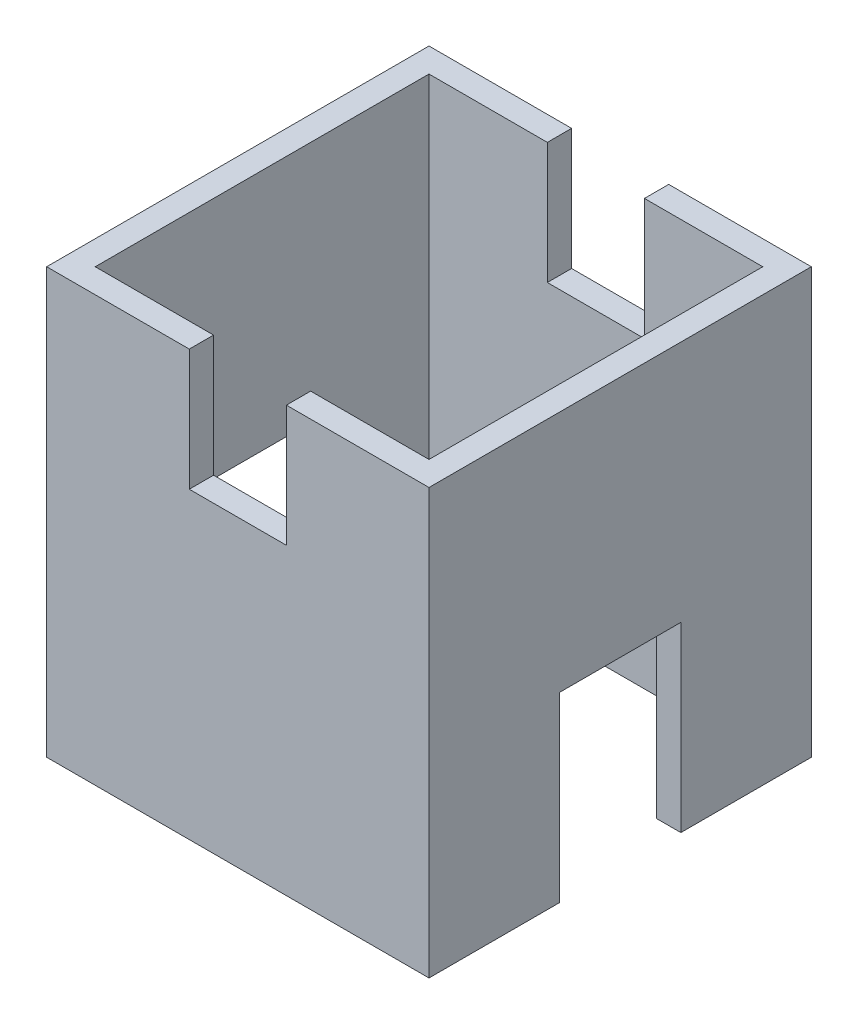
ISO-10303-21;
HEADER;
FILE_DESCRIPTION(('STEP AP214'),'2;1');
FILE_NAME('part.step','',(''),(''),'','','');
FILE_SCHEMA(('AUTOMOTIVE_DESIGN { 1 0 10303 214 1 1 1 1 }'));
ENDSEC;
DATA;
#1=APPLICATION_CONTEXT('core data for automotive mechanical design processes');
#2=APPLICATION_PROTOCOL_DEFINITION('international standard','automotive_design',2000,#1);
#3=PRODUCT_CONTEXT('',#1,'mechanical');
#4=PRODUCT('Part','Part','',(#3));
#5=PRODUCT_RELATED_PRODUCT_CATEGORY('part','',(#4));
#6=PRODUCT_DEFINITION_FORMATION('','',#4);
#7=PRODUCT_DEFINITION_CONTEXT('part definition',#1,'design');
#8=PRODUCT_DEFINITION('design','',#6,#7);
#9=PRODUCT_DEFINITION_SHAPE('','',#8);
#10=(LENGTH_UNIT() NAMED_UNIT(*) SI_UNIT(.MILLI.,.METRE.));
#11=(NAMED_UNIT(*) PLANE_ANGLE_UNIT() SI_UNIT($,.RADIAN.));
#12=(NAMED_UNIT(*) SI_UNIT($,.STERADIAN.) SOLID_ANGLE_UNIT());
#13=UNCERTAINTY_MEASURE_WITH_UNIT(LENGTH_MEASURE(1.E-05),#10,'distance_accuracy_value','');
#14=(GEOMETRIC_REPRESENTATION_CONTEXT(3) GLOBAL_UNCERTAINTY_ASSIGNED_CONTEXT((#13)) GLOBAL_UNIT_ASSIGNED_CONTEXT((#10,
#11,#12)) REPRESENTATION_CONTEXT('',''));
#15=CARTESIAN_POINT('',(0.,0.,0.));
#16=DIRECTION('',(0.,0.,1.));
#17=DIRECTION('',(1.,0.,0.));
#18=AXIS2_PLACEMENT_3D('',#15,#16,#17);
#19=CARTESIAN_POINT('',(0.,35.,0.));
#20=DIRECTION('',(0.,-1.,0.));
#21=DIRECTION('',(0.,0.,-1.));
#22=AXIS2_PLACEMENT_3D('',#19,#20,#21);
#23=PLANE('',#22);
#24=DIRECTION('',(-1.,0.,0.));
#25=VECTOR('',#24,1.);
#26=CARTESIAN_POINT('',(15.75,35.,-15.75));
#27=LINE('',#26,#25);
#28=CARTESIAN_POINT('',(15.75,35.,-15.75));
#29=VERTEX_POINT('',#28);
#30=CARTESIAN_POINT('',(4.,35.,-15.75));
#31=VERTEX_POINT('',#30);
#32=EDGE_CURVE('E319',#29,#31,#27,.T.);
#33=ORIENTED_EDGE('',*,*,#32,.T.);
#34=DIRECTION('',(0.,0.,-1.));
#35=VECTOR('',#34,1.);
#36=CARTESIAN_POINT('',(4.,35.,15.75));
#37=LINE('',#36,#35);
#38=CARTESIAN_POINT('',(4.,35.,-13.75));
#39=VERTEX_POINT('',#38);
#40=EDGE_CURVE('E226',#39,#31,#37,.T.);
#41=ORIENTED_EDGE('',*,*,#40,.F.);
#42=DIRECTION('',(-1.,0.,0.));
#43=VECTOR('',#42,1.);
#44=CARTESIAN_POINT('',(13.75,35.,-13.75));
#45=LINE('',#44,#43);
#46=CARTESIAN_POINT('',(13.75,35.,-13.75));
#47=VERTEX_POINT('',#46);
#48=EDGE_CURVE('E286',#47,#39,#45,.T.);
#49=ORIENTED_EDGE('',*,*,#48,.F.);
#50=DIRECTION('',(0.,0.,-1.));
#51=VECTOR('',#50,1.);
#52=CARTESIAN_POINT('',(13.75,35.,13.75));
#53=LINE('',#52,#51);
#54=CARTESIAN_POINT('',(13.75,35.,13.75));
#55=VERTEX_POINT('',#54);
#56=EDGE_CURVE('E282',#55,#47,#53,.T.);
#57=ORIENTED_EDGE('',*,*,#56,.F.);
#58=DIRECTION('',(1.,0.,0.));
#59=VECTOR('',#58,1.);
#60=CARTESIAN_POINT('',(13.75,35.,13.75));
#61=LINE('',#60,#59);
#62=CARTESIAN_POINT('',(4.,35.,13.75));
#63=VERTEX_POINT('',#62);
#64=EDGE_CURVE('E277',#63,#55,#61,.T.);
#65=ORIENTED_EDGE('',*,*,#64,.F.);
#66=CARTESIAN_POINT('',(4.,35.,15.75));
#67=VERTEX_POINT('',#66);
#68=EDGE_CURVE('E223',#67,#63,#37,.T.);
#69=ORIENTED_EDGE('',*,*,#68,.F.);
#70=DIRECTION('',(1.,0.,0.));
#71=VECTOR('',#70,1.);
#72=CARTESIAN_POINT('',(15.75,35.,15.75));
#73=LINE('',#72,#71);
#74=CARTESIAN_POINT('',(15.75,35.,15.75));
#75=VERTEX_POINT('',#74);
#76=EDGE_CURVE('E212',#67,#75,#73,.T.);
#77=ORIENTED_EDGE('',*,*,#76,.T.);
#78=DIRECTION('',(0.,0.,-1.));
#79=VECTOR('',#78,1.);
#80=CARTESIAN_POINT('',(15.75,35.,15.75));
#81=LINE('',#80,#79);
#82=EDGE_CURVE('E316',#75,#29,#81,.T.);
#83=ORIENTED_EDGE('',*,*,#82,.T.);
#84=EDGE_LOOP('',(#33,#41,#49,#57,#65,#69,#77,#83));
#85=FACE_BOUND('',#84,.T.);
#86=ADVANCED_FACE('F33',(#85),#23,.F.);
#87=CARTESIAN_POINT('',(0.,0.,0.));
#88=DIRECTION('',(0.,-1.,0.));
#89=DIRECTION('',(0.,0.,-1.));
#90=AXIS2_PLACEMENT_3D('',#87,#88,#89);
#91=PLANE('',#90);
#92=DIRECTION('',(1.,0.,0.));
#93=VECTOR('',#92,1.);
#94=CARTESIAN_POINT('',(-15.75,0.,5.));
#95=LINE('',#94,#93);
#96=CARTESIAN_POINT('',(13.75,0.,5.));
#97=VERTEX_POINT('',#96);
#98=CARTESIAN_POINT('',(15.75,0.,5.));
#99=VERTEX_POINT('',#98);
#100=EDGE_CURVE('E247',#97,#99,#95,.T.);
#101=ORIENTED_EDGE('',*,*,#100,.T.);
#102=DIRECTION('',(0.,0.,-1.));
#103=VECTOR('',#102,1.);
#104=CARTESIAN_POINT('',(15.75,0.,15.75));
#105=LINE('',#104,#103);
#106=CARTESIAN_POINT('',(15.75,0.,15.75));
#107=VERTEX_POINT('',#106);
#108=EDGE_CURVE('E328',#107,#99,#105,.T.);
#109=ORIENTED_EDGE('',*,*,#108,.F.);
#110=DIRECTION('',(1.,0.,0.));
#111=VECTOR('',#110,1.);
#112=CARTESIAN_POINT('',(15.75,0.,15.75));
#113=LINE('',#112,#111);
#114=CARTESIAN_POINT('',(-15.75,0.,15.75));
#115=VERTEX_POINT('',#114);
#116=EDGE_CURVE('E312',#115,#107,#113,.T.);
#117=ORIENTED_EDGE('',*,*,#116,.F.);
#118=DIRECTION('',(0.,0.,1.));
#119=VECTOR('',#118,1.);
#120=CARTESIAN_POINT('',(-15.75,0.,15.75));
#121=LINE('',#120,#119);
#122=CARTESIAN_POINT('',(-15.75,0.,5.));
#123=VERTEX_POINT('',#122);
#124=EDGE_CURVE('E333',#123,#115,#121,.T.);
#125=ORIENTED_EDGE('',*,*,#124,.F.);
#126=CARTESIAN_POINT('',(-13.75,0.,5.));
#127=VERTEX_POINT('',#126);
#128=EDGE_CURVE('E266',#123,#127,#95,.T.);
#129=ORIENTED_EDGE('',*,*,#128,.T.);
#130=DIRECTION('',(0.,0.,1.));
#131=VECTOR('',#130,1.);
#132=CARTESIAN_POINT('',(-13.75,0.,13.75));
#133=LINE('',#132,#131);
#134=CARTESIAN_POINT('',(-13.75,0.,13.75));
#135=VERTEX_POINT('',#134);
#136=EDGE_CURVE('E274',#127,#135,#133,.T.);
#137=ORIENTED_EDGE('',*,*,#136,.T.);
#138=DIRECTION('',(1.,0.,0.));
#139=VECTOR('',#138,1.);
#140=CARTESIAN_POINT('',(13.75,0.,13.75));
#141=LINE('',#140,#139);
#142=CARTESIAN_POINT('',(13.75,0.,13.75));
#143=VERTEX_POINT('',#142);
#144=EDGE_CURVE('E293',#135,#143,#141,.T.);
#145=ORIENTED_EDGE('',*,*,#144,.T.);
#146=DIRECTION('',(0.,0.,-1.));
#147=VECTOR('',#146,1.);
#148=CARTESIAN_POINT('',(13.75,0.,13.75));
#149=LINE('',#148,#147);
#150=EDGE_CURVE('E297',#143,#97,#149,.T.);
#151=ORIENTED_EDGE('',*,*,#150,.T.);
#152=EDGE_LOOP('',(#101,#109,#117,#125,#129,#137,#145,#151));
#153=FACE_BOUND('',#152,.T.);
#154=ADVANCED_FACE('F425',(#153),#91,.T.);
#155=CARTESIAN_POINT('',(-15.75,35.,15.75));
#156=VERTEX_POINT('',#155);
#157=CARTESIAN_POINT('',(-4.,35.,15.75));
#158=VERTEX_POINT('',#157);
#159=EDGE_CURVE('E313',#156,#158,#73,.T.);
#160=ORIENTED_EDGE('',*,*,#159,.T.);
#161=DIRECTION('',(0.,0.,-1.));
#162=VECTOR('',#161,1.);
#163=CARTESIAN_POINT('',(-4.,35.,15.75));
#164=LINE('',#163,#162);
#165=CARTESIAN_POINT('',(-4.,35.,13.75));
#166=VERTEX_POINT('',#165);
#167=EDGE_CURVE('E227',#158,#166,#164,.T.);
#168=ORIENTED_EDGE('',*,*,#167,.T.);
#169=CARTESIAN_POINT('',(-13.75,35.,13.75));
#170=VERTEX_POINT('',#169);
#171=EDGE_CURVE('E279',#170,#166,#61,.T.);
#172=ORIENTED_EDGE('',*,*,#171,.F.);
#173=DIRECTION('',(0.,0.,1.));
#174=VECTOR('',#173,1.);
#175=CARTESIAN_POINT('',(-13.75,35.,13.75));
#176=LINE('',#175,#174);
#177=CARTESIAN_POINT('',(-13.75,35.,-13.75));
#178=VERTEX_POINT('',#177);
#179=EDGE_CURVE('E275',#178,#170,#176,.T.);
#180=ORIENTED_EDGE('',*,*,#179,.F.);
#181=CARTESIAN_POINT('',(-4.,35.,-13.75));
#182=VERTEX_POINT('',#181);
#183=EDGE_CURVE('E285',#182,#178,#45,.T.);
#184=ORIENTED_EDGE('',*,*,#183,.F.);
#185=CARTESIAN_POINT('',(-4.,35.,-15.75));
#186=VERTEX_POINT('',#185);
#187=EDGE_CURVE('E230',#182,#186,#164,.T.);
#188=ORIENTED_EDGE('',*,*,#187,.T.);
#189=CARTESIAN_POINT('',(-15.75,35.,-15.75));
#190=VERTEX_POINT('',#189);
#191=EDGE_CURVE('E318',#186,#190,#27,.T.);
#192=ORIENTED_EDGE('',*,*,#191,.T.);
#193=DIRECTION('',(0.,0.,1.));
#194=VECTOR('',#193,1.);
#195=CARTESIAN_POINT('',(-15.75,35.,15.75));
#196=LINE('',#195,#194);
#197=EDGE_CURVE('E322',#190,#156,#196,.T.);
#198=ORIENTED_EDGE('',*,*,#197,.T.);
#199=EDGE_LOOP('',(#160,#168,#172,#180,#184,#188,#192,#198));
#200=FACE_BOUND('',#199,.T.);
#201=ADVANCED_FACE('F379',(#200),#23,.F.);
#202=DIRECTION('',(1.,0.,0.));
#203=VECTOR('',#202,1.);
#204=CARTESIAN_POINT('',(-15.75,0.,-5.00000000000001));
#205=LINE('',#204,#203);
#206=CARTESIAN_POINT('',(-15.75,0.,-5.00000000000001));
#207=VERTEX_POINT('',#206);
#208=CARTESIAN_POINT('',(-13.75,0.,-5.));
#209=VERTEX_POINT('',#208);
#210=EDGE_CURVE('E263',#207,#209,#205,.T.);
#211=ORIENTED_EDGE('',*,*,#210,.F.);
#212=CARTESIAN_POINT('',(-15.75,0.,-15.75));
#213=VERTEX_POINT('',#212);
#214=EDGE_CURVE('E334',#213,#207,#121,.T.);
#215=ORIENTED_EDGE('',*,*,#214,.F.);
#216=DIRECTION('',(-1.,0.,0.));
#217=VECTOR('',#216,1.);
#218=CARTESIAN_POINT('',(15.75,0.,-15.75));
#219=LINE('',#218,#217);
#220=CARTESIAN_POINT('',(15.75,0.,-15.75));
#221=VERTEX_POINT('',#220);
#222=EDGE_CURVE('E331',#221,#213,#219,.T.);
#223=ORIENTED_EDGE('',*,*,#222,.F.);
#224=CARTESIAN_POINT('',(15.75,0.,-5.00000000000001));
#225=VERTEX_POINT('',#224);
#226=EDGE_CURVE('E327',#225,#221,#105,.T.);
#227=ORIENTED_EDGE('',*,*,#226,.F.);
#228=CARTESIAN_POINT('',(13.75,0.,-5.00000000000001));
#229=VERTEX_POINT('',#228);
#230=EDGE_CURVE('E265',#229,#225,#205,.T.);
#231=ORIENTED_EDGE('',*,*,#230,.F.);
#232=CARTESIAN_POINT('',(13.75,0.,-13.75));
#233=VERTEX_POINT('',#232);
#234=EDGE_CURVE('E296',#229,#233,#149,.T.);
#235=ORIENTED_EDGE('',*,*,#234,.T.);
#236=DIRECTION('',(-1.,0.,0.));
#237=VECTOR('',#236,1.);
#238=CARTESIAN_POINT('',(13.75,0.,-13.75));
#239=LINE('',#238,#237);
#240=CARTESIAN_POINT('',(-13.75,0.,-13.75));
#241=VERTEX_POINT('',#240);
#242=EDGE_CURVE('E278',#233,#241,#239,.T.);
#243=ORIENTED_EDGE('',*,*,#242,.T.);
#244=EDGE_CURVE('E290',#241,#209,#133,.T.);
#245=ORIENTED_EDGE('',*,*,#244,.T.);
#246=EDGE_LOOP('',(#211,#215,#223,#227,#231,#235,#243,#245));
#247=FACE_BOUND('',#246,.T.);
#248=ADVANCED_FACE('F392',(#247),#91,.T.);
#249=CARTESIAN_POINT('',(15.75,35.,15.75));
#250=DIRECTION('',(0.,0.,-1.));
#251=DIRECTION('',(-1.,0.,0.));
#252=AXIS2_PLACEMENT_3D('',#249,#250,#251);
#253=PLANE('',#252);
#254=ORIENTED_EDGE('',*,*,#76,.F.);
#255=DIRECTION('',(0.,-1.,0.));
#256=VECTOR('',#255,1.);
#257=CARTESIAN_POINT('',(4.,25.,15.75));
#258=LINE('',#257,#256);
#259=CARTESIAN_POINT('',(4.,25.,15.75));
#260=VERTEX_POINT('',#259);
#261=EDGE_CURVE('E193',#67,#260,#258,.T.);
#262=ORIENTED_EDGE('',*,*,#261,.T.);
#263=DIRECTION('',(-1.,0.,0.));
#264=VECTOR('',#263,1.);
#265=CARTESIAN_POINT('',(-4.,25.,15.75));
#266=LINE('',#265,#264);
#267=CARTESIAN_POINT('',(-4.,25.,15.75));
#268=VERTEX_POINT('',#267);
#269=EDGE_CURVE('E201',#260,#268,#266,.T.);
#270=ORIENTED_EDGE('',*,*,#269,.T.);
#271=DIRECTION('',(0.,1.,0.));
#272=VECTOR('',#271,1.);
#273=CARTESIAN_POINT('',(-4.,25.,15.75));
#274=LINE('',#273,#272);
#275=EDGE_CURVE('E208',#268,#158,#274,.T.);
#276=ORIENTED_EDGE('',*,*,#275,.T.);
#277=ORIENTED_EDGE('',*,*,#159,.F.);
#278=DIRECTION('',(0.,-1.,0.));
#279=VECTOR('',#278,1.);
#280=CARTESIAN_POINT('',(-15.75,35.,15.75));
#281=LINE('',#280,#279);
#282=EDGE_CURVE('E324',#156,#115,#281,.T.);
#283=ORIENTED_EDGE('',*,*,#282,.T.);
#284=ORIENTED_EDGE('',*,*,#116,.T.);
#285=DIRECTION('',(0.,-1.,0.));
#286=VECTOR('',#285,1.);
#287=CARTESIAN_POINT('',(15.75,35.,15.75));
#288=LINE('',#287,#286);
#289=EDGE_CURVE('E345',#75,#107,#288,.T.);
#290=ORIENTED_EDGE('',*,*,#289,.F.);
#291=EDGE_LOOP('',(#254,#262,#270,#276,#277,#283,#284,#290));
#292=FACE_BOUND('',#291,.T.);
#293=ADVANCED_FACE('F35',(#292),#253,.F.);
#294=CARTESIAN_POINT('',(15.75,35.,15.75));
#295=DIRECTION('',(-1.,0.,0.));
#296=DIRECTION('',(0.,0.,1.));
#297=AXIS2_PLACEMENT_3D('',#294,#295,#296);
#298=PLANE('',#297);
#299=ORIENTED_EDGE('',*,*,#108,.T.);
#300=DIRECTION('',(0.,-1.,0.));
#301=VECTOR('',#300,1.);
#302=CARTESIAN_POINT('',(15.75,15.,5.));
#303=LINE('',#302,#301);
#304=CARTESIAN_POINT('',(15.75,15.,5.));
#305=VERTEX_POINT('',#304);
#306=EDGE_CURVE('E236',#305,#99,#303,.T.);
#307=ORIENTED_EDGE('',*,*,#306,.F.);
#308=DIRECTION('',(0.,0.,1.));
#309=VECTOR('',#308,1.);
#310=CARTESIAN_POINT('',(15.75,15.,-5.));
#311=LINE('',#310,#309);
#312=CARTESIAN_POINT('',(15.75,15.,-5.));
#313=VERTEX_POINT('',#312);
#314=EDGE_CURVE('E241',#313,#305,#311,.T.);
#315=ORIENTED_EDGE('',*,*,#314,.F.);
#316=DIRECTION('',(0.,1.,0.));
#317=VECTOR('',#316,1.);
#318=CARTESIAN_POINT('',(15.75,15.,-5.));
#319=LINE('',#318,#317);
#320=EDGE_CURVE('E249',#225,#313,#319,.T.);
#321=ORIENTED_EDGE('',*,*,#320,.F.);
#322=ORIENTED_EDGE('',*,*,#226,.T.);
#323=DIRECTION('',(0.,-1.,0.));
#324=VECTOR('',#323,1.);
#325=CARTESIAN_POINT('',(15.75,35.,-15.75));
#326=LINE('',#325,#324);
#327=EDGE_CURVE('E342',#29,#221,#326,.T.);
#328=ORIENTED_EDGE('',*,*,#327,.F.);
#329=ORIENTED_EDGE('',*,*,#82,.F.);
#330=ORIENTED_EDGE('',*,*,#289,.T.);
#331=EDGE_LOOP('',(#299,#307,#315,#321,#322,#328,#329,#330));
#332=FACE_BOUND('',#331,.T.);
#333=ADVANCED_FACE('F462',(#332),#298,.F.);
#334=CARTESIAN_POINT('',(15.75,35.,-15.75));
#335=DIRECTION('',(0.,0.,1.));
#336=DIRECTION('',(1.,0.,0.));
#337=AXIS2_PLACEMENT_3D('',#334,#335,#336);
#338=PLANE('',#337);
#339=DIRECTION('',(-1.,0.,0.));
#340=VECTOR('',#339,1.);
#341=CARTESIAN_POINT('',(-4.,25.,-15.75));
#342=LINE('',#341,#340);
#343=CARTESIAN_POINT('',(4.,25.,-15.75));
#344=VERTEX_POINT('',#343);
#345=CARTESIAN_POINT('',(-4.,25.,-15.75));
#346=VERTEX_POINT('',#345);
#347=EDGE_CURVE('E215',#344,#346,#342,.T.);
#348=ORIENTED_EDGE('',*,*,#347,.F.);
#349=DIRECTION('',(0.,-1.,0.));
#350=VECTOR('',#349,1.);
#351=CARTESIAN_POINT('',(4.,25.,-15.75));
#352=LINE('',#351,#350);
#353=EDGE_CURVE('E219',#31,#344,#352,.T.);
#354=ORIENTED_EDGE('',*,*,#353,.F.);
#355=ORIENTED_EDGE('',*,*,#32,.F.);
#356=ORIENTED_EDGE('',*,*,#327,.T.);
#357=ORIENTED_EDGE('',*,*,#222,.T.);
#358=DIRECTION('',(0.,-1.,0.));
#359=VECTOR('',#358,1.);
#360=CARTESIAN_POINT('',(-15.75,35.,-15.75));
#361=LINE('',#360,#359);
#362=EDGE_CURVE('E339',#190,#213,#361,.T.);
#363=ORIENTED_EDGE('',*,*,#362,.F.);
#364=ORIENTED_EDGE('',*,*,#191,.F.);
#365=DIRECTION('',(0.,1.,0.));
#366=VECTOR('',#365,1.);
#367=CARTESIAN_POINT('',(-4.,25.,-15.75));
#368=LINE('',#367,#366);
#369=EDGE_CURVE('E213',#346,#186,#368,.T.);
#370=ORIENTED_EDGE('',*,*,#369,.F.);
#371=EDGE_LOOP('',(#348,#354,#355,#356,#357,#363,#364,#370));
#372=FACE_BOUND('',#371,.T.);
#373=ADVANCED_FACE('F375',(#372),#338,.F.);
#374=CARTESIAN_POINT('',(-15.75,35.,15.75));
#375=DIRECTION('',(1.,0.,0.));
#376=DIRECTION('',(0.,0.,-1.));
#377=AXIS2_PLACEMENT_3D('',#374,#375,#376);
#378=PLANE('',#377);
#379=DIRECTION('',(0.,0.,1.));
#380=VECTOR('',#379,1.);
#381=CARTESIAN_POINT('',(-15.75,15.,-5.));
#382=LINE('',#381,#380);
#383=CARTESIAN_POINT('',(-15.75,15.,-5.));
#384=VERTEX_POINT('',#383);
#385=CARTESIAN_POINT('',(-15.75,15.,5.));
#386=VERTEX_POINT('',#385);
#387=EDGE_CURVE('E244',#384,#386,#382,.T.);
#388=ORIENTED_EDGE('',*,*,#387,.T.);
#389=DIRECTION('',(0.,-1.,0.));
#390=VECTOR('',#389,1.);
#391=CARTESIAN_POINT('',(-15.75,15.,5.));
#392=LINE('',#391,#390);
#393=EDGE_CURVE('E237',#386,#123,#392,.T.);
#394=ORIENTED_EDGE('',*,*,#393,.T.);
#395=ORIENTED_EDGE('',*,*,#124,.T.);
#396=ORIENTED_EDGE('',*,*,#282,.F.);
#397=ORIENTED_EDGE('',*,*,#197,.F.);
#398=ORIENTED_EDGE('',*,*,#362,.T.);
#399=ORIENTED_EDGE('',*,*,#214,.T.);
#400=DIRECTION('',(0.,1.,0.));
#401=VECTOR('',#400,1.);
#402=CARTESIAN_POINT('',(-15.75,15.,-5.));
#403=LINE('',#402,#401);
#404=EDGE_CURVE('E240',#207,#384,#403,.T.);
#405=ORIENTED_EDGE('',*,*,#404,.T.);
#406=EDGE_LOOP('',(#388,#394,#395,#396,#397,#398,#399,#405));
#407=FACE_BOUND('',#406,.T.);
#408=ADVANCED_FACE('F411',(#407),#378,.F.);
#409=CARTESIAN_POINT('',(-13.75,35.,13.75));
#410=DIRECTION('',(1.,0.,0.));
#411=DIRECTION('',(0.,0.,-1.));
#412=AXIS2_PLACEMENT_3D('',#409,#410,#411);
#413=PLANE('',#412);
#414=DIRECTION('',(0.,-1.,0.));
#415=VECTOR('',#414,1.);
#416=CARTESIAN_POINT('',(-13.75,35.,5.));
#417=LINE('',#416,#415);
#418=CARTESIAN_POINT('',(-13.75,15.,5.));
#419=VERTEX_POINT('',#418);
#420=EDGE_CURVE('E272',#419,#127,#417,.T.);
#421=ORIENTED_EDGE('',*,*,#420,.F.);
#422=DIRECTION('',(0.,0.,1.));
#423=VECTOR('',#422,1.);
#424=CARTESIAN_POINT('',(-13.75,15.,13.75));
#425=LINE('',#424,#423);
#426=CARTESIAN_POINT('',(-13.75,15.,-5.));
#427=VERTEX_POINT('',#426);
#428=EDGE_CURVE('E270',#427,#419,#425,.T.);
#429=ORIENTED_EDGE('',*,*,#428,.F.);
#430=DIRECTION('',(0.,1.,0.));
#431=VECTOR('',#430,1.);
#432=CARTESIAN_POINT('',(-13.75,35.,-4.99999999999999));
#433=LINE('',#432,#431);
#434=EDGE_CURVE('E257',#209,#427,#433,.T.);
#435=ORIENTED_EDGE('',*,*,#434,.F.);
#436=ORIENTED_EDGE('',*,*,#244,.F.);
#437=DIRECTION('',(0.,-1.,0.));
#438=VECTOR('',#437,1.);
#439=CARTESIAN_POINT('',(-13.75,35.,-13.75));
#440=LINE('',#439,#438);
#441=EDGE_CURVE('E289',#178,#241,#440,.T.);
#442=ORIENTED_EDGE('',*,*,#441,.F.);
#443=ORIENTED_EDGE('',*,*,#179,.T.);
#444=DIRECTION('',(0.,-1.,0.));
#445=VECTOR('',#444,1.);
#446=CARTESIAN_POINT('',(-13.75,35.,13.75));
#447=LINE('',#446,#445);
#448=EDGE_CURVE('E309',#170,#135,#447,.T.);
#449=ORIENTED_EDGE('',*,*,#448,.T.);
#450=ORIENTED_EDGE('',*,*,#136,.F.);
#451=EDGE_LOOP('',(#421,#429,#435,#436,#442,#443,#449,#450));
#452=FACE_BOUND('',#451,.T.);
#453=ADVANCED_FACE('F386',(#452),#413,.T.);
#454=CARTESIAN_POINT('',(13.75,35.,13.75));
#455=DIRECTION('',(0.,0.,-1.));
#456=DIRECTION('',(-1.,0.,0.));
#457=AXIS2_PLACEMENT_3D('',#454,#455,#456);
#458=PLANE('',#457);
#459=DIRECTION('',(0.,-1.,0.));
#460=VECTOR('',#459,1.);
#461=CARTESIAN_POINT('',(4.,35.,13.75));
#462=LINE('',#461,#460);
#463=CARTESIAN_POINT('',(4.,25.,13.75));
#464=VERTEX_POINT('',#463);
#465=EDGE_CURVE('E196',#63,#464,#462,.T.);
#466=ORIENTED_EDGE('',*,*,#465,.F.);
#467=ORIENTED_EDGE('',*,*,#64,.T.);
#468=DIRECTION('',(0.,-1.,0.));
#469=VECTOR('',#468,1.);
#470=CARTESIAN_POINT('',(13.75,35.,13.75));
#471=LINE('',#470,#469);
#472=EDGE_CURVE('E307',#55,#143,#471,.T.);
#473=ORIENTED_EDGE('',*,*,#472,.T.);
#474=ORIENTED_EDGE('',*,*,#144,.F.);
#475=ORIENTED_EDGE('',*,*,#448,.F.);
#476=ORIENTED_EDGE('',*,*,#171,.T.);
#477=DIRECTION('',(0.,1.,0.));
#478=VECTOR('',#477,1.);
#479=CARTESIAN_POINT('',(-4.,35.,13.75));
#480=LINE('',#479,#478);
#481=CARTESIAN_POINT('',(-4.,25.,13.75));
#482=VERTEX_POINT('',#481);
#483=EDGE_CURVE('E233',#482,#166,#480,.T.);
#484=ORIENTED_EDGE('',*,*,#483,.F.);
#485=DIRECTION('',(-1.,0.,0.));
#486=VECTOR('',#485,1.);
#487=CARTESIAN_POINT('',(13.75,25.,13.75));
#488=LINE('',#487,#486);
#489=EDGE_CURVE('E225',#464,#482,#488,.T.);
#490=ORIENTED_EDGE('',*,*,#489,.F.);
#491=EDGE_LOOP('',(#466,#467,#473,#474,#475,#476,#484,#490));
#492=FACE_BOUND('',#491,.T.);
#493=ADVANCED_FACE('F420',(#492),#458,.T.);
#494=CARTESIAN_POINT('',(13.75,35.,13.75));
#495=DIRECTION('',(-1.,0.,0.));
#496=DIRECTION('',(0.,0.,1.));
#497=AXIS2_PLACEMENT_3D('',#494,#495,#496);
#498=PLANE('',#497);
#499=DIRECTION('',(0.,1.,0.));
#500=VECTOR('',#499,1.);
#501=CARTESIAN_POINT('',(13.75,35.,5.));
#502=LINE('',#501,#500);
#503=CARTESIAN_POINT('',(13.75,15.,5.));
#504=VERTEX_POINT('',#503);
#505=EDGE_CURVE('E353',#97,#504,#502,.T.);
#506=ORIENTED_EDGE('',*,*,#505,.F.);
#507=ORIENTED_EDGE('',*,*,#150,.F.);
#508=ORIENTED_EDGE('',*,*,#472,.F.);
#509=ORIENTED_EDGE('',*,*,#56,.T.);
#510=DIRECTION('',(0.,-1.,0.));
#511=VECTOR('',#510,1.);
#512=CARTESIAN_POINT('',(13.75,35.,-13.75));
#513=LINE('',#512,#511);
#514=EDGE_CURVE('E304',#47,#233,#513,.T.);
#515=ORIENTED_EDGE('',*,*,#514,.T.);
#516=ORIENTED_EDGE('',*,*,#234,.F.);
#517=DIRECTION('',(0.,-1.,0.));
#518=VECTOR('',#517,1.);
#519=CARTESIAN_POINT('',(13.75,35.,-4.99999999999999));
#520=LINE('',#519,#518);
#521=CARTESIAN_POINT('',(13.75,15.,-5.));
#522=VERTEX_POINT('',#521);
#523=EDGE_CURVE('E348',#522,#229,#520,.T.);
#524=ORIENTED_EDGE('',*,*,#523,.F.);
#525=DIRECTION('',(0.,0.,-1.));
#526=VECTOR('',#525,1.);
#527=CARTESIAN_POINT('',(13.75,15.,13.75));
#528=LINE('',#527,#526);
#529=EDGE_CURVE('E350',#504,#522,#528,.T.);
#530=ORIENTED_EDGE('',*,*,#529,.F.);
#531=EDGE_LOOP('',(#506,#507,#508,#509,#515,#516,#524,#530));
#532=FACE_BOUND('',#531,.T.);
#533=ADVANCED_FACE('F401',(#532),#498,.T.);
#534=CARTESIAN_POINT('',(13.75,35.,-13.75));
#535=DIRECTION('',(0.,0.,1.));
#536=DIRECTION('',(1.,0.,0.));
#537=AXIS2_PLACEMENT_3D('',#534,#535,#536);
#538=PLANE('',#537);
#539=DIRECTION('',(0.,1.,0.));
#540=VECTOR('',#539,1.);
#541=CARTESIAN_POINT('',(4.,35.,-13.75));
#542=LINE('',#541,#540);
#543=CARTESIAN_POINT('',(4.,25.,-13.75));
#544=VERTEX_POINT('',#543);
#545=EDGE_CURVE('E11',#544,#39,#542,.T.);
#546=ORIENTED_EDGE('',*,*,#545,.F.);
#547=DIRECTION('',(1.,0.,0.));
#548=VECTOR('',#547,1.);
#549=CARTESIAN_POINT('',(13.75,25.,-13.75));
#550=LINE('',#549,#548);
#551=CARTESIAN_POINT('',(-4.,25.,-13.75));
#552=VERTEX_POINT('',#551);
#553=EDGE_CURVE('E355',#552,#544,#550,.T.);
#554=ORIENTED_EDGE('',*,*,#553,.F.);
#555=DIRECTION('',(0.,-1.,0.));
#556=VECTOR('',#555,1.);
#557=CARTESIAN_POINT('',(-4.,35.,-13.75));
#558=LINE('',#557,#556);
#559=EDGE_CURVE('E41',#182,#552,#558,.T.);
#560=ORIENTED_EDGE('',*,*,#559,.F.);
#561=ORIENTED_EDGE('',*,*,#183,.T.);
#562=ORIENTED_EDGE('',*,*,#441,.T.);
#563=ORIENTED_EDGE('',*,*,#242,.F.);
#564=ORIENTED_EDGE('',*,*,#514,.F.);
#565=ORIENTED_EDGE('',*,*,#48,.T.);
#566=EDGE_LOOP('',(#546,#554,#560,#561,#562,#563,#564,#565));
#567=FACE_BOUND('',#566,.T.);
#568=ADVANCED_FACE('F364',(#567),#538,.T.);
#569=CARTESIAN_POINT('',(-15.75,15.,-5.));
#570=DIRECTION('',(0.,0.,-1.));
#571=DIRECTION('',(0.,1.,0.));
#572=AXIS2_PLACEMENT_3D('',#569,#570,#571);
#573=PLANE('',#572);
#574=ORIENTED_EDGE('',*,*,#523,.T.);
#575=ORIENTED_EDGE('',*,*,#230,.T.);
#576=ORIENTED_EDGE('',*,*,#320,.T.);
#577=DIRECTION('',(1.,0.,0.));
#578=VECTOR('',#577,1.);
#579=CARTESIAN_POINT('',(-15.75,15.,-5.));
#580=LINE('',#579,#578);
#581=EDGE_CURVE('E262',#522,#313,#580,.T.);
#582=ORIENTED_EDGE('',*,*,#581,.F.);
#583=EDGE_LOOP('',(#574,#575,#576,#582));
#584=FACE_BOUND('',#583,.T.);
#585=ADVANCED_FACE('F437',(#584),#573,.F.);
#586=CARTESIAN_POINT('',(-15.75,15.,-5.));
#587=DIRECTION('',(0.,1.,0.));
#588=DIRECTION('',(0.,0.,1.));
#589=AXIS2_PLACEMENT_3D('',#586,#587,#588);
#590=PLANE('',#589);
#591=ORIENTED_EDGE('',*,*,#529,.T.);
#592=ORIENTED_EDGE('',*,*,#581,.T.);
#593=ORIENTED_EDGE('',*,*,#314,.T.);
#594=DIRECTION('',(1.,0.,0.));
#595=VECTOR('',#594,1.);
#596=CARTESIAN_POINT('',(-15.75,15.,5.));
#597=LINE('',#596,#595);
#598=EDGE_CURVE('E258',#504,#305,#597,.T.);
#599=ORIENTED_EDGE('',*,*,#598,.F.);
#600=EDGE_LOOP('',(#591,#592,#593,#599));
#601=FACE_BOUND('',#600,.T.);
#602=ADVANCED_FACE('F444',(#601),#590,.F.);
#603=CARTESIAN_POINT('',(-15.75,15.,5.));
#604=DIRECTION('',(0.,0.,1.));
#605=DIRECTION('',(0.,-1.,0.));
#606=AXIS2_PLACEMENT_3D('',#603,#604,#605);
#607=PLANE('',#606);
#608=ORIENTED_EDGE('',*,*,#505,.T.);
#609=ORIENTED_EDGE('',*,*,#598,.T.);
#610=ORIENTED_EDGE('',*,*,#306,.T.);
#611=ORIENTED_EDGE('',*,*,#100,.F.);
#612=EDGE_LOOP('',(#608,#609,#610,#611));
#613=FACE_BOUND('',#612,.T.);
#614=ADVANCED_FACE('F473',(#613),#607,.F.);
#615=ORIENTED_EDGE('',*,*,#420,.T.);
#616=ORIENTED_EDGE('',*,*,#128,.F.);
#617=ORIENTED_EDGE('',*,*,#393,.F.);
#618=EDGE_CURVE('E254',#386,#419,#597,.T.);
#619=ORIENTED_EDGE('',*,*,#618,.T.);
#620=EDGE_LOOP('',(#615,#616,#617,#619));
#621=FACE_BOUND('',#620,.T.);
#622=ADVANCED_FACE('F429',(#621),#607,.F.);
#623=ORIENTED_EDGE('',*,*,#428,.T.);
#624=ORIENTED_EDGE('',*,*,#618,.F.);
#625=ORIENTED_EDGE('',*,*,#387,.F.);
#626=EDGE_CURVE('E259',#384,#427,#580,.T.);
#627=ORIENTED_EDGE('',*,*,#626,.T.);
#628=EDGE_LOOP('',(#623,#624,#625,#627));
#629=FACE_BOUND('',#628,.T.);
#630=ADVANCED_FACE('F432',(#629),#590,.F.);
#631=ORIENTED_EDGE('',*,*,#434,.T.);
#632=ORIENTED_EDGE('',*,*,#626,.F.);
#633=ORIENTED_EDGE('',*,*,#404,.F.);
#634=ORIENTED_EDGE('',*,*,#210,.T.);
#635=EDGE_LOOP('',(#631,#632,#633,#634));
#636=FACE_BOUND('',#635,.T.);
#637=ADVANCED_FACE('F434',(#636),#573,.F.);
#638=CARTESIAN_POINT('',(-4.,25.,15.75));
#639=DIRECTION('',(0.,-1.,0.));
#640=DIRECTION('',(0.,0.,-1.));
#641=AXIS2_PLACEMENT_3D('',#638,#639,#640);
#642=PLANE('',#641);
#643=ORIENTED_EDGE('',*,*,#553,.T.);
#644=DIRECTION('',(0.,0.,-1.));
#645=VECTOR('',#644,1.);
#646=CARTESIAN_POINT('',(4.,25.,15.75));
#647=LINE('',#646,#645);
#648=EDGE_CURVE('E198',#544,#344,#647,.T.);
#649=ORIENTED_EDGE('',*,*,#648,.T.);
#650=ORIENTED_EDGE('',*,*,#347,.T.);
#651=DIRECTION('',(0.,0.,-1.));
#652=VECTOR('',#651,1.);
#653=CARTESIAN_POINT('',(-4.,25.,15.75));
#654=LINE('',#653,#652);
#655=EDGE_CURVE('E56',#552,#346,#654,.T.);
#656=ORIENTED_EDGE('',*,*,#655,.F.);
#657=EDGE_LOOP('',(#643,#649,#650,#656));
#658=FACE_BOUND('',#657,.T.);
#659=ADVANCED_FACE('F366',(#658),#642,.F.);
#660=CARTESIAN_POINT('',(-4.,25.,15.75));
#661=DIRECTION('',(-1.,0.,0.));
#662=DIRECTION('',(0.,0.,1.));
#663=AXIS2_PLACEMENT_3D('',#660,#661,#662);
#664=PLANE('',#663);
#665=ORIENTED_EDGE('',*,*,#559,.T.);
#666=ORIENTED_EDGE('',*,*,#655,.T.);
#667=ORIENTED_EDGE('',*,*,#369,.T.);
#668=ORIENTED_EDGE('',*,*,#187,.F.);
#669=EDGE_LOOP('',(#665,#666,#667,#668));
#670=FACE_BOUND('',#669,.T.);
#671=ADVANCED_FACE('F359',(#670),#664,.F.);
#672=CARTESIAN_POINT('',(4.,25.,15.75));
#673=DIRECTION('',(1.,0.,0.));
#674=DIRECTION('',(0.,0.,-1.));
#675=AXIS2_PLACEMENT_3D('',#672,#673,#674);
#676=PLANE('',#675);
#677=ORIENTED_EDGE('',*,*,#545,.T.);
#678=ORIENTED_EDGE('',*,*,#40,.T.);
#679=ORIENTED_EDGE('',*,*,#353,.T.);
#680=ORIENTED_EDGE('',*,*,#648,.F.);
#681=EDGE_LOOP('',(#677,#678,#679,#680));
#682=FACE_BOUND('',#681,.T.);
#683=ADVANCED_FACE('F368',(#682),#676,.F.);
#684=ORIENTED_EDGE('',*,*,#465,.T.);
#685=EDGE_CURVE('E48',#260,#464,#647,.T.);
#686=ORIENTED_EDGE('',*,*,#685,.F.);
#687=ORIENTED_EDGE('',*,*,#261,.F.);
#688=ORIENTED_EDGE('',*,*,#68,.T.);
#689=EDGE_LOOP('',(#684,#686,#687,#688));
#690=FACE_BOUND('',#689,.T.);
#691=ADVANCED_FACE('F191',(#690),#676,.F.);
#692=ORIENTED_EDGE('',*,*,#483,.T.);
#693=ORIENTED_EDGE('',*,*,#167,.F.);
#694=ORIENTED_EDGE('',*,*,#275,.F.);
#695=EDGE_CURVE('E204',#268,#482,#654,.T.);
#696=ORIENTED_EDGE('',*,*,#695,.T.);
#697=EDGE_LOOP('',(#692,#693,#694,#696));
#698=FACE_BOUND('',#697,.T.);
#699=ADVANCED_FACE('F417',(#698),#664,.F.);
#700=ORIENTED_EDGE('',*,*,#489,.T.);
#701=ORIENTED_EDGE('',*,*,#695,.F.);
#702=ORIENTED_EDGE('',*,*,#269,.F.);
#703=ORIENTED_EDGE('',*,*,#685,.T.);
#704=EDGE_LOOP('',(#700,#701,#702,#703));
#705=FACE_BOUND('',#704,.T.);
#706=ADVANCED_FACE('F202',(#705),#642,.F.);
#707=CLOSED_SHELL('',(#86,#154,#201,#248,#293,#333,#373,#408,#453,#493,#533,#568,#585,#602,#614,
#622,#630,#637,#659,#671,#683,#691,#699,#706));
#708=MANIFOLD_SOLID_BREP('B2',#707);
#709=ADVANCED_BREP_SHAPE_REPRESENTATION('',(#18,#708),#14);
#710=SHAPE_DEFINITION_REPRESENTATION(#9,#709);
ENDSEC;
END-ISO-10303-21;
